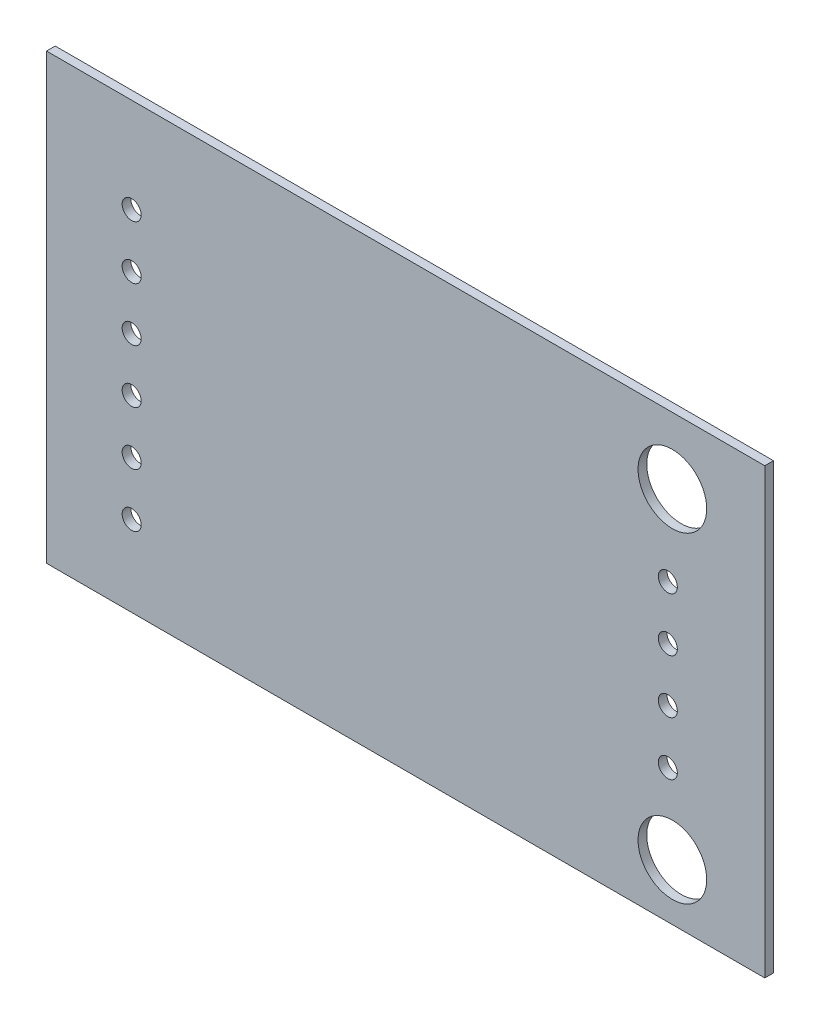
ISO-10303-21;
HEADER;
FILE_DESCRIPTION(('STEP AP214'),'2;1');
FILE_NAME('part.step','',(''),(''),'','','');
FILE_SCHEMA(('AUTOMOTIVE_DESIGN { 1 0 10303 214 1 1 1 1 }'));
ENDSEC;
DATA;
#1=APPLICATION_CONTEXT('core data for automotive mechanical design processes');
#2=APPLICATION_PROTOCOL_DEFINITION('international standard','automotive_design',2000,#1);
#3=PRODUCT_CONTEXT('',#1,'mechanical');
#4=PRODUCT('Part','Part','',(#3));
#5=PRODUCT_RELATED_PRODUCT_CATEGORY('part','',(#4));
#6=PRODUCT_DEFINITION_FORMATION('','',#4);
#7=PRODUCT_DEFINITION_CONTEXT('part definition',#1,'design');
#8=PRODUCT_DEFINITION('design','',#6,#7);
#9=PRODUCT_DEFINITION_SHAPE('','',#8);
#10=(LENGTH_UNIT() NAMED_UNIT(*) SI_UNIT(.MILLI.,.METRE.));
#11=(NAMED_UNIT(*) PLANE_ANGLE_UNIT() SI_UNIT($,.RADIAN.));
#12=(NAMED_UNIT(*) SI_UNIT($,.STERADIAN.) SOLID_ANGLE_UNIT());
#13=UNCERTAINTY_MEASURE_WITH_UNIT(LENGTH_MEASURE(1.E-05),#10,'distance_accuracy_value','');
#14=(GEOMETRIC_REPRESENTATION_CONTEXT(3) GLOBAL_UNCERTAINTY_ASSIGNED_CONTEXT((#13)) GLOBAL_UNIT_ASSIGNED_CONTEXT((#10,
#11,#12)) REPRESENTATION_CONTEXT('',''));
#15=CARTESIAN_POINT('',(0.,0.,0.));
#16=DIRECTION('',(0.,0.,1.));
#17=DIRECTION('',(1.,0.,0.));
#18=AXIS2_PLACEMENT_3D('',#15,#16,#17);
#19=CARTESIAN_POINT('',(1.26999999976454E-05,21.00001642,0.));
#20=DIRECTION('',(-1.,0.,0.));
#21=DIRECTION('',(0.,-1.,0.));
#22=AXIS2_PLACEMENT_3D('',#19,#20,#21);
#23=PLANE('',#22);
#24=DIRECTION('',(0.,-1.,0.));
#25=VECTOR('',#24,1.);
#26=CARTESIAN_POINT('',(1.26999999976454E-05,21.00001642,0.41148));
#27=LINE('',#26,#25);
#28=CARTESIAN_POINT('',(1.26999999976454E-05,21.00001642,0.41148));
#29=VERTEX_POINT('',#28);
#30=CARTESIAN_POINT('',(1.26999999992E-05,1.26999999994702E-05,0.41148));
#31=VERTEX_POINT('',#30);
#32=EDGE_CURVE('E99',#29,#31,#27,.T.);
#33=ORIENTED_EDGE('',*,*,#32,.F.);
#34=DIRECTION('',(0.,0.,1.));
#35=VECTOR('',#34,1.);
#36=CARTESIAN_POINT('',(1.26999999976454E-05,21.00001642,0.));
#37=LINE('',#36,#35);
#38=CARTESIAN_POINT('',(1.26999999976454E-05,21.00001642,0.));
#39=VERTEX_POINT('',#38);
#40=EDGE_CURVE('E11',#39,#29,#37,.T.);
#41=ORIENTED_EDGE('',*,*,#40,.F.);
#42=DIRECTION('',(0.,-1.,0.));
#43=VECTOR('',#42,1.);
#44=CARTESIAN_POINT('',(1.26999999976454E-05,21.00001642,0.));
#45=LINE('',#44,#43);
#46=CARTESIAN_POINT('',(1.26999999992E-05,1.26999999994702E-05,0.));
#47=VERTEX_POINT('',#46);
#48=EDGE_CURVE('E92',#39,#47,#45,.T.);
#49=ORIENTED_EDGE('',*,*,#48,.T.);
#50=DIRECTION('',(0.,0.,1.));
#51=VECTOR('',#50,1.);
#52=CARTESIAN_POINT('',(1.26999999992E-05,1.26999999994702E-05,0.));
#53=LINE('',#52,#51);
#54=EDGE_CURVE('E37',#47,#31,#53,.T.);
#55=ORIENTED_EDGE('',*,*,#54,.T.);
#56=EDGE_LOOP('',(#33,#41,#49,#55));
#57=FACE_BOUND('',#56,.T.);
#58=ADVANCED_FACE('F34',(#57),#23,.T.);
#59=CARTESIAN_POINT('',(34.00001582,21.00001642,0.));
#60=DIRECTION('',(0.,1.,0.));
#61=DIRECTION('',(0.,0.,1.));
#62=AXIS2_PLACEMENT_3D('',#59,#60,#61);
#63=PLANE('',#62);
#64=DIRECTION('',(-1.,0.,0.));
#65=VECTOR('',#64,1.);
#66=CARTESIAN_POINT('',(34.00001582,21.00001642,0.41148));
#67=LINE('',#66,#65);
#68=CARTESIAN_POINT('',(34.00001582,21.00001642,0.41148));
#69=VERTEX_POINT('',#68);
#70=EDGE_CURVE('E94',#69,#29,#67,.T.);
#71=ORIENTED_EDGE('',*,*,#70,.F.);
#72=DIRECTION('',(0.,0.,1.));
#73=VECTOR('',#72,1.);
#74=CARTESIAN_POINT('',(34.00001582,21.00001642,0.));
#75=LINE('',#74,#73);
#76=CARTESIAN_POINT('',(34.00001582,21.00001642,0.));
#77=VERTEX_POINT('',#76);
#78=EDGE_CURVE('E43',#77,#69,#75,.T.);
#79=ORIENTED_EDGE('',*,*,#78,.F.);
#80=DIRECTION('',(-1.,0.,0.));
#81=VECTOR('',#80,1.);
#82=CARTESIAN_POINT('',(34.00001582,21.00001642,0.));
#83=LINE('',#82,#81);
#84=EDGE_CURVE('E89',#77,#39,#83,.T.);
#85=ORIENTED_EDGE('',*,*,#84,.T.);
#86=ORIENTED_EDGE('',*,*,#40,.T.);
#87=EDGE_LOOP('',(#71,#79,#85,#86));
#88=FACE_BOUND('',#87,.T.);
#89=ADVANCED_FACE('F110',(#88),#63,.T.);
#90=CARTESIAN_POINT('',(34.00001582,1.26999999993801E-05,0.));
#91=DIRECTION('',(1.,0.,0.));
#92=DIRECTION('',(0.,0.,-1.));
#93=AXIS2_PLACEMENT_3D('',#90,#91,#92);
#94=PLANE('',#93);
#95=DIRECTION('',(0.,1.,0.));
#96=VECTOR('',#95,1.);
#97=CARTESIAN_POINT('',(34.00001582,1.26999999993801E-05,0.41148));
#98=LINE('',#97,#96);
#99=CARTESIAN_POINT('',(34.00001582,1.26999999993801E-05,0.41148));
#100=VERTEX_POINT('',#99);
#101=EDGE_CURVE('E84',#100,#69,#98,.T.);
#102=ORIENTED_EDGE('',*,*,#101,.F.);
#103=DIRECTION('',(0.,0.,1.));
#104=VECTOR('',#103,1.);
#105=CARTESIAN_POINT('',(34.00001582,1.26999999993801E-05,0.));
#106=LINE('',#105,#104);
#107=CARTESIAN_POINT('',(34.00001582,1.26999999993801E-05,0.));
#108=VERTEX_POINT('',#107);
#109=EDGE_CURVE('E79',#108,#100,#106,.T.);
#110=ORIENTED_EDGE('',*,*,#109,.F.);
#111=DIRECTION('',(0.,1.,0.));
#112=VECTOR('',#111,1.);
#113=CARTESIAN_POINT('',(34.00001582,1.26999999993801E-05,0.));
#114=LINE('',#113,#112);
#115=EDGE_CURVE('E82',#108,#77,#114,.T.);
#116=ORIENTED_EDGE('',*,*,#115,.T.);
#117=ORIENTED_EDGE('',*,*,#78,.T.);
#118=EDGE_LOOP('',(#102,#110,#116,#117));
#119=FACE_BOUND('',#118,.T.);
#120=ADVANCED_FACE('F81',(#119),#94,.T.);
#121=CARTESIAN_POINT('',(1.26999999992E-05,1.26999999994702E-05,0.));
#122=DIRECTION('',(0.,-1.,0.));
#123=DIRECTION('',(1.,0.,0.));
#124=AXIS2_PLACEMENT_3D('',#121,#122,#123);
#125=PLANE('',#124);
#126=DIRECTION('',(1.,0.,0.));
#127=VECTOR('',#126,1.);
#128=CARTESIAN_POINT('',(1.26999999992E-05,1.26999999994702E-05,0.41148));
#129=LINE('',#128,#127);
#130=EDGE_CURVE('E102',#31,#100,#129,.T.);
#131=ORIENTED_EDGE('',*,*,#130,.F.);
#132=ORIENTED_EDGE('',*,*,#54,.F.);
#133=DIRECTION('',(1.,0.,0.));
#134=VECTOR('',#133,1.);
#135=CARTESIAN_POINT('',(1.26999999992E-05,1.26999999994702E-05,0.));
#136=LINE('',#135,#134);
#137=EDGE_CURVE('E88',#47,#108,#136,.T.);
#138=ORIENTED_EDGE('',*,*,#137,.T.);
#139=ORIENTED_EDGE('',*,*,#109,.T.);
#140=EDGE_LOOP('',(#131,#132,#138,#139));
#141=FACE_BOUND('',#140,.T.);
#142=ADVANCED_FACE('F91',(#141),#125,.T.);
#143=CARTESIAN_POINT('',(0.,0.,0.));
#144=DIRECTION('',(0.,0.,1.));
#145=DIRECTION('',(1.,0.,0.));
#146=AXIS2_PLACEMENT_3D('',#143,#144,#145);
#147=PLANE('',#146);
#148=CARTESIAN_POINT('',(29.6250486426004,2.6582362187213,0.));
#149=DIRECTION('',(0.,0.,1.));
#150=DIRECTION('',(1.,0.,0.));
#151=AXIS2_PLACEMENT_3D('',#148,#149,#150);
#152=CIRCLE('',#151,1.62499999999999);
#153=CARTESIAN_POINT('',(31.2500486426004,2.6582362187213,0.));
#154=VERTEX_POINT('',#153);
#155=EDGE_CURVE('E183',#154,#154,#152,.T.);
#156=ORIENTED_EDGE('',*,*,#155,.T.);
#157=EDGE_LOOP('',(#156));
#158=FACE_BOUND('',#157,.T.);
#159=CARTESIAN_POINT('',(29.6250486426004,17.858037309221,0.));
#160=DIRECTION('',(0.,0.,1.));
#161=DIRECTION('',(1.,0.,0.));
#162=AXIS2_PLACEMENT_3D('',#159,#160,#161);
#163=CIRCLE('',#162,1.625);
#164=CARTESIAN_POINT('',(31.2500486426004,17.858037309221,0.));
#165=VERTEX_POINT('',#164);
#166=EDGE_CURVE('E191',#165,#165,#163,.T.);
#167=ORIENTED_EDGE('',*,*,#166,.T.);
#168=EDGE_LOOP('',(#167));
#169=FACE_BOUND('',#168,.T.);
#170=CARTESIAN_POINT('',(4.03071762183416,8.89547967678131,0.));
#171=DIRECTION('',(0.,0.,1.));
#172=DIRECTION('',(-1.,0.,0.));
#173=AXIS2_PLACEMENT_3D('',#170,#171,#172);
#174=CIRCLE('',#173,0.4499991);
#175=CARTESIAN_POINT('',(3.58071852183416,8.89547967678131,0.));
#176=VERTEX_POINT('',#175);
#177=EDGE_CURVE('E197',#176,#176,#174,.T.);
#178=ORIENTED_EDGE('',*,*,#177,.T.);
#179=EDGE_LOOP('',(#178));
#180=FACE_BOUND('',#179,.T.);
#181=CARTESIAN_POINT('',(4.03071762183416,6.35547967678131,0.));
#182=DIRECTION('',(0.,0.,1.));
#183=DIRECTION('',(-1.,0.,0.));
#184=AXIS2_PLACEMENT_3D('',#181,#182,#183);
#185=CIRCLE('',#184,0.4499991);
#186=CARTESIAN_POINT('',(3.58071852183416,6.35547967678131,0.));
#187=VERTEX_POINT('',#186);
#188=EDGE_CURVE('E203',#187,#187,#185,.T.);
#189=ORIENTED_EDGE('',*,*,#188,.T.);
#190=EDGE_LOOP('',(#189));
#191=FACE_BOUND('',#190,.T.);
#192=CARTESIAN_POINT('',(4.03071762183416,16.5154796767813,0.));
#193=DIRECTION('',(0.,0.,1.));
#194=DIRECTION('',(-1.,0.,0.));
#195=AXIS2_PLACEMENT_3D('',#192,#193,#194);
#196=CIRCLE('',#195,0.449999100000001);
#197=CARTESIAN_POINT('',(3.58071852183416,16.5154796767813,0.));
#198=VERTEX_POINT('',#197);
#199=EDGE_CURVE('E209',#198,#198,#196,.T.);
#200=ORIENTED_EDGE('',*,*,#199,.T.);
#201=EDGE_LOOP('',(#200));
#202=FACE_BOUND('',#201,.T.);
#203=CARTESIAN_POINT('',(4.03071762183416,11.4354796767813,0.));
#204=DIRECTION('',(0.,0.,1.));
#205=DIRECTION('',(-1.,0.,0.));
#206=AXIS2_PLACEMENT_3D('',#203,#204,#205);
#207=CIRCLE('',#206,0.4499991);
#208=CARTESIAN_POINT('',(3.58071852183416,11.4354796767813,0.));
#209=VERTEX_POINT('',#208);
#210=EDGE_CURVE('E215',#209,#209,#207,.T.);
#211=ORIENTED_EDGE('',*,*,#210,.T.);
#212=EDGE_LOOP('',(#211));
#213=FACE_BOUND('',#212,.T.);
#214=CARTESIAN_POINT('',(4.03071762183416,13.9754796767813,0.));
#215=DIRECTION('',(0.,0.,1.));
#216=DIRECTION('',(-1.,0.,0.));
#217=AXIS2_PLACEMENT_3D('',#214,#215,#216);
#218=CIRCLE('',#217,0.4499991);
#219=CARTESIAN_POINT('',(3.58071852183416,13.9754796767813,0.));
#220=VERTEX_POINT('',#219);
#221=EDGE_CURVE('E221',#220,#220,#218,.T.);
#222=ORIENTED_EDGE('',*,*,#221,.T.);
#223=EDGE_LOOP('',(#222));
#224=FACE_BOUND('',#223,.T.);
#225=CARTESIAN_POINT('',(4.03071762183416,3.81547967678131,0.));
#226=DIRECTION('',(0.,0.,1.));
#227=DIRECTION('',(-1.,0.,0.));
#228=AXIS2_PLACEMENT_3D('',#225,#226,#227);
#229=CIRCLE('',#228,0.4499991);
#230=CARTESIAN_POINT('',(3.58071852183416,3.81547967678131,0.));
#231=VERTEX_POINT('',#230);
#232=EDGE_CURVE('E227',#231,#231,#229,.T.);
#233=ORIENTED_EDGE('',*,*,#232,.T.);
#234=EDGE_LOOP('',(#233));
#235=FACE_BOUND('',#234,.T.);
#236=CARTESIAN_POINT('',(29.409885994145,6.33181355797748,0.));
#237=DIRECTION('',(0.,0.,1.));
#238=DIRECTION('',(-1.,0.,0.));
#239=AXIS2_PLACEMENT_3D('',#236,#237,#238);
#240=CIRCLE('',#239,0.4499991);
#241=CARTESIAN_POINT('',(28.959886894145,6.33181355797748,0.));
#242=VERTEX_POINT('',#241);
#243=EDGE_CURVE('E233',#242,#242,#240,.T.);
#244=ORIENTED_EDGE('',*,*,#243,.T.);
#245=EDGE_LOOP('',(#244));
#246=FACE_BOUND('',#245,.T.);
#247=CARTESIAN_POINT('',(29.409885994145,13.9518135579775,0.));
#248=DIRECTION('',(0.,0.,1.));
#249=DIRECTION('',(-1.,0.,0.));
#250=AXIS2_PLACEMENT_3D('',#247,#248,#249);
#251=CIRCLE('',#250,0.4499991);
#252=CARTESIAN_POINT('',(28.959886894145,13.9518135579775,0.));
#253=VERTEX_POINT('',#252);
#254=EDGE_CURVE('E239',#253,#253,#251,.T.);
#255=ORIENTED_EDGE('',*,*,#254,.T.);
#256=EDGE_LOOP('',(#255));
#257=FACE_BOUND('',#256,.T.);
#258=CARTESIAN_POINT('',(29.409885994145,8.87181355797748,0.));
#259=DIRECTION('',(0.,0.,1.));
#260=DIRECTION('',(-1.,0.,0.));
#261=AXIS2_PLACEMENT_3D('',#258,#259,#260);
#262=CIRCLE('',#261,0.4499991);
#263=CARTESIAN_POINT('',(28.959886894145,8.87181355797748,0.));
#264=VERTEX_POINT('',#263);
#265=EDGE_CURVE('E245',#264,#264,#262,.T.);
#266=ORIENTED_EDGE('',*,*,#265,.T.);
#267=EDGE_LOOP('',(#266));
#268=FACE_BOUND('',#267,.T.);
#269=CARTESIAN_POINT('',(29.409885994145,11.4118135579775,0.));
#270=DIRECTION('',(0.,0.,1.));
#271=DIRECTION('',(-1.,0.,0.));
#272=AXIS2_PLACEMENT_3D('',#269,#270,#271);
#273=CIRCLE('',#272,0.4499991);
#274=CARTESIAN_POINT('',(28.959886894145,11.4118135579775,0.));
#275=VERTEX_POINT('',#274);
#276=EDGE_CURVE('E103',#275,#275,#273,.T.);
#277=ORIENTED_EDGE('',*,*,#276,.T.);
#278=EDGE_LOOP('',(#277));
#279=FACE_BOUND('',#278,.T.);
#280=ORIENTED_EDGE('',*,*,#48,.F.);
#281=ORIENTED_EDGE('',*,*,#84,.F.);
#282=ORIENTED_EDGE('',*,*,#115,.F.);
#283=ORIENTED_EDGE('',*,*,#137,.F.);
#284=EDGE_LOOP('',(#280,#281,#282,#283));
#285=FACE_BOUND('',#284,.T.);
#286=ADVANCED_FACE('F87',(#158,#169,#180,#191,#202,#213,#224,#235,#246,#257,#268,#279,#285),
#147,.F.);
#287=CARTESIAN_POINT('',(0.,0.,0.41148));
#288=DIRECTION('',(0.,0.,1.));
#289=DIRECTION('',(1.,0.,0.));
#290=AXIS2_PLACEMENT_3D('',#287,#288,#289);
#291=PLANE('',#290);
#292=CARTESIAN_POINT('',(29.6250486426004,2.6582362187213,0.41148));
#293=DIRECTION('',(0.,0.,1.));
#294=DIRECTION('',(1.,0.,0.));
#295=AXIS2_PLACEMENT_3D('',#292,#293,#294);
#296=CIRCLE('',#295,1.62499999999999);
#297=CARTESIAN_POINT('',(31.2500486426004,2.6582362187213,0.41148));
#298=VERTEX_POINT('',#297);
#299=EDGE_CURVE('E186',#298,#298,#296,.T.);
#300=ORIENTED_EDGE('',*,*,#299,.F.);
#301=EDGE_LOOP('',(#300));
#302=FACE_BOUND('',#301,.T.);
#303=CARTESIAN_POINT('',(29.6250486426004,17.858037309221,0.41148));
#304=DIRECTION('',(0.,0.,1.));
#305=DIRECTION('',(1.,0.,0.));
#306=AXIS2_PLACEMENT_3D('',#303,#304,#305);
#307=CIRCLE('',#306,1.625);
#308=CARTESIAN_POINT('',(31.2500486426004,17.858037309221,0.41148));
#309=VERTEX_POINT('',#308);
#310=EDGE_CURVE('E188',#309,#309,#307,.T.);
#311=ORIENTED_EDGE('',*,*,#310,.F.);
#312=EDGE_LOOP('',(#311));
#313=FACE_BOUND('',#312,.T.);
#314=CARTESIAN_POINT('',(4.03071762183416,8.89547967678131,0.41148));
#315=DIRECTION('',(0.,0.,1.));
#316=DIRECTION('',(-1.,0.,0.));
#317=AXIS2_PLACEMENT_3D('',#314,#315,#316);
#318=CIRCLE('',#317,0.4499991);
#319=CARTESIAN_POINT('',(3.58071852183416,8.89547967678131,0.41148));
#320=VERTEX_POINT('',#319);
#321=EDGE_CURVE('E194',#320,#320,#318,.T.);
#322=ORIENTED_EDGE('',*,*,#321,.F.);
#323=EDGE_LOOP('',(#322));
#324=FACE_BOUND('',#323,.T.);
#325=CARTESIAN_POINT('',(4.03071762183416,6.35547967678131,0.41148));
#326=DIRECTION('',(0.,0.,1.));
#327=DIRECTION('',(-1.,0.,0.));
#328=AXIS2_PLACEMENT_3D('',#325,#326,#327);
#329=CIRCLE('',#328,0.4499991);
#330=CARTESIAN_POINT('',(3.58071852183416,6.35547967678131,0.41148));
#331=VERTEX_POINT('',#330);
#332=EDGE_CURVE('E200',#331,#331,#329,.T.);
#333=ORIENTED_EDGE('',*,*,#332,.F.);
#334=EDGE_LOOP('',(#333));
#335=FACE_BOUND('',#334,.T.);
#336=CARTESIAN_POINT('',(4.03071762183416,16.5154796767813,0.41148));
#337=DIRECTION('',(0.,0.,1.));
#338=DIRECTION('',(-1.,0.,0.));
#339=AXIS2_PLACEMENT_3D('',#336,#337,#338);
#340=CIRCLE('',#339,0.449999100000001);
#341=CARTESIAN_POINT('',(3.58071852183416,16.5154796767813,0.41148));
#342=VERTEX_POINT('',#341);
#343=EDGE_CURVE('E206',#342,#342,#340,.T.);
#344=ORIENTED_EDGE('',*,*,#343,.F.);
#345=EDGE_LOOP('',(#344));
#346=FACE_BOUND('',#345,.T.);
#347=CARTESIAN_POINT('',(4.03071762183416,11.4354796767813,0.41148));
#348=DIRECTION('',(0.,0.,1.));
#349=DIRECTION('',(-1.,0.,0.));
#350=AXIS2_PLACEMENT_3D('',#347,#348,#349);
#351=CIRCLE('',#350,0.4499991);
#352=CARTESIAN_POINT('',(3.58071852183416,11.4354796767813,0.41148));
#353=VERTEX_POINT('',#352);
#354=EDGE_CURVE('E212',#353,#353,#351,.T.);
#355=ORIENTED_EDGE('',*,*,#354,.F.);
#356=EDGE_LOOP('',(#355));
#357=FACE_BOUND('',#356,.T.);
#358=CARTESIAN_POINT('',(4.03071762183416,13.9754796767813,0.41148));
#359=DIRECTION('',(0.,0.,1.));
#360=DIRECTION('',(-1.,0.,0.));
#361=AXIS2_PLACEMENT_3D('',#358,#359,#360);
#362=CIRCLE('',#361,0.4499991);
#363=CARTESIAN_POINT('',(3.58071852183416,13.9754796767813,0.41148));
#364=VERTEX_POINT('',#363);
#365=EDGE_CURVE('E218',#364,#364,#362,.T.);
#366=ORIENTED_EDGE('',*,*,#365,.F.);
#367=EDGE_LOOP('',(#366));
#368=FACE_BOUND('',#367,.T.);
#369=CARTESIAN_POINT('',(4.03071762183416,3.81547967678131,0.41148));
#370=DIRECTION('',(0.,0.,1.));
#371=DIRECTION('',(-1.,0.,0.));
#372=AXIS2_PLACEMENT_3D('',#369,#370,#371);
#373=CIRCLE('',#372,0.4499991);
#374=CARTESIAN_POINT('',(3.58071852183416,3.81547967678131,0.41148));
#375=VERTEX_POINT('',#374);
#376=EDGE_CURVE('E224',#375,#375,#373,.T.);
#377=ORIENTED_EDGE('',*,*,#376,.F.);
#378=EDGE_LOOP('',(#377));
#379=FACE_BOUND('',#378,.T.);
#380=CARTESIAN_POINT('',(29.409885994145,6.33181355797748,0.41148));
#381=DIRECTION('',(0.,0.,1.));
#382=DIRECTION('',(-1.,0.,0.));
#383=AXIS2_PLACEMENT_3D('',#380,#381,#382);
#384=CIRCLE('',#383,0.4499991);
#385=CARTESIAN_POINT('',(28.959886894145,6.33181355797748,0.41148));
#386=VERTEX_POINT('',#385);
#387=EDGE_CURVE('E230',#386,#386,#384,.T.);
#388=ORIENTED_EDGE('',*,*,#387,.F.);
#389=EDGE_LOOP('',(#388));
#390=FACE_BOUND('',#389,.T.);
#391=CARTESIAN_POINT('',(29.409885994145,13.9518135579775,0.41148));
#392=DIRECTION('',(0.,0.,1.));
#393=DIRECTION('',(-1.,0.,0.));
#394=AXIS2_PLACEMENT_3D('',#391,#392,#393);
#395=CIRCLE('',#394,0.4499991);
#396=CARTESIAN_POINT('',(28.959886894145,13.9518135579775,0.41148));
#397=VERTEX_POINT('',#396);
#398=EDGE_CURVE('E236',#397,#397,#395,.T.);
#399=ORIENTED_EDGE('',*,*,#398,.F.);
#400=EDGE_LOOP('',(#399));
#401=FACE_BOUND('',#400,.T.);
#402=CARTESIAN_POINT('',(29.409885994145,8.87181355797748,0.41148));
#403=DIRECTION('',(0.,0.,1.));
#404=DIRECTION('',(-1.,0.,0.));
#405=AXIS2_PLACEMENT_3D('',#402,#403,#404);
#406=CIRCLE('',#405,0.4499991);
#407=CARTESIAN_POINT('',(28.959886894145,8.87181355797748,0.41148));
#408=VERTEX_POINT('',#407);
#409=EDGE_CURVE('E242',#408,#408,#406,.T.);
#410=ORIENTED_EDGE('',*,*,#409,.F.);
#411=EDGE_LOOP('',(#410));
#412=FACE_BOUND('',#411,.T.);
#413=CARTESIAN_POINT('',(29.409885994145,11.4118135579775,0.41148));
#414=DIRECTION('',(0.,0.,1.));
#415=DIRECTION('',(-1.,0.,0.));
#416=AXIS2_PLACEMENT_3D('',#413,#414,#415);
#417=CIRCLE('',#416,0.4499991);
#418=CARTESIAN_POINT('',(28.959886894145,11.4118135579775,0.41148));
#419=VERTEX_POINT('',#418);
#420=EDGE_CURVE('E248',#419,#419,#417,.T.);
#421=ORIENTED_EDGE('',*,*,#420,.F.);
#422=EDGE_LOOP('',(#421));
#423=FACE_BOUND('',#422,.T.);
#424=ORIENTED_EDGE('',*,*,#32,.T.);
#425=ORIENTED_EDGE('',*,*,#130,.T.);
#426=ORIENTED_EDGE('',*,*,#101,.T.);
#427=ORIENTED_EDGE('',*,*,#70,.T.);
#428=EDGE_LOOP('',(#424,#425,#426,#427));
#429=FACE_BOUND('',#428,.T.);
#430=ADVANCED_FACE('F109',(#302,#313,#324,#335,#346,#357,#368,#379,#390,#401,#412,#423,#429),
#291,.T.);
#431=CARTESIAN_POINT('',(29.409885994145,11.4118135579775,0.));
#432=DIRECTION('',(0.,0.,1.));
#433=DIRECTION('',(1.,0.,0.));
#434=AXIS2_PLACEMENT_3D('',#431,#432,#433);
#435=CYLINDRICAL_SURFACE('',#434,0.4499991);
#436=ORIENTED_EDGE('',*,*,#276,.F.);
#437=EDGE_LOOP('',(#436));
#438=FACE_BOUND('',#437,.T.);
#439=ORIENTED_EDGE('',*,*,#420,.T.);
#440=EDGE_LOOP('',(#439));
#441=FACE_BOUND('',#440,.T.);
#442=ADVANCED_FACE('F128',(#438,#441),#435,.F.);
#443=CARTESIAN_POINT('',(29.409885994145,8.87181355797748,0.));
#444=DIRECTION('',(0.,0.,1.));
#445=DIRECTION('',(1.,0.,0.));
#446=AXIS2_PLACEMENT_3D('',#443,#444,#445);
#447=CYLINDRICAL_SURFACE('',#446,0.4499991);
#448=ORIENTED_EDGE('',*,*,#265,.F.);
#449=EDGE_LOOP('',(#448));
#450=FACE_BOUND('',#449,.T.);
#451=ORIENTED_EDGE('',*,*,#409,.T.);
#452=EDGE_LOOP('',(#451));
#453=FACE_BOUND('',#452,.T.);
#454=ADVANCED_FACE('F135',(#450,#453),#447,.F.);
#455=CARTESIAN_POINT('',(29.409885994145,13.9518135579775,0.));
#456=DIRECTION('',(0.,0.,1.));
#457=DIRECTION('',(1.,0.,0.));
#458=AXIS2_PLACEMENT_3D('',#455,#456,#457);
#459=CYLINDRICAL_SURFACE('',#458,0.4499991);
#460=ORIENTED_EDGE('',*,*,#254,.F.);
#461=EDGE_LOOP('',(#460));
#462=FACE_BOUND('',#461,.T.);
#463=ORIENTED_EDGE('',*,*,#398,.T.);
#464=EDGE_LOOP('',(#463));
#465=FACE_BOUND('',#464,.T.);
#466=ADVANCED_FACE('F139',(#462,#465),#459,.F.);
#467=CARTESIAN_POINT('',(29.409885994145,6.33181355797748,0.));
#468=DIRECTION('',(0.,0.,1.));
#469=DIRECTION('',(1.,0.,0.));
#470=AXIS2_PLACEMENT_3D('',#467,#468,#469);
#471=CYLINDRICAL_SURFACE('',#470,0.4499991);
#472=ORIENTED_EDGE('',*,*,#243,.F.);
#473=EDGE_LOOP('',(#472));
#474=FACE_BOUND('',#473,.T.);
#475=ORIENTED_EDGE('',*,*,#387,.T.);
#476=EDGE_LOOP('',(#475));
#477=FACE_BOUND('',#476,.T.);
#478=ADVANCED_FACE('F143',(#474,#477),#471,.F.);
#479=CARTESIAN_POINT('',(4.03071762183416,3.81547967678131,0.));
#480=DIRECTION('',(0.,0.,1.));
#481=DIRECTION('',(1.,0.,0.));
#482=AXIS2_PLACEMENT_3D('',#479,#480,#481);
#483=CYLINDRICAL_SURFACE('',#482,0.4499991);
#484=ORIENTED_EDGE('',*,*,#232,.F.);
#485=EDGE_LOOP('',(#484));
#486=FACE_BOUND('',#485,.T.);
#487=ORIENTED_EDGE('',*,*,#376,.T.);
#488=EDGE_LOOP('',(#487));
#489=FACE_BOUND('',#488,.T.);
#490=ADVANCED_FACE('F147',(#486,#489),#483,.F.);
#491=CARTESIAN_POINT('',(4.03071762183416,13.9754796767813,0.));
#492=DIRECTION('',(0.,0.,1.));
#493=DIRECTION('',(1.,0.,0.));
#494=AXIS2_PLACEMENT_3D('',#491,#492,#493);
#495=CYLINDRICAL_SURFACE('',#494,0.4499991);
#496=ORIENTED_EDGE('',*,*,#221,.F.);
#497=EDGE_LOOP('',(#496));
#498=FACE_BOUND('',#497,.T.);
#499=ORIENTED_EDGE('',*,*,#365,.T.);
#500=EDGE_LOOP('',(#499));
#501=FACE_BOUND('',#500,.T.);
#502=ADVANCED_FACE('F151',(#498,#501),#495,.F.);
#503=CARTESIAN_POINT('',(4.03071762183416,11.4354796767813,0.));
#504=DIRECTION('',(0.,0.,1.));
#505=DIRECTION('',(1.,0.,0.));
#506=AXIS2_PLACEMENT_3D('',#503,#504,#505);
#507=CYLINDRICAL_SURFACE('',#506,0.4499991);
#508=ORIENTED_EDGE('',*,*,#210,.F.);
#509=EDGE_LOOP('',(#508));
#510=FACE_BOUND('',#509,.T.);
#511=ORIENTED_EDGE('',*,*,#354,.T.);
#512=EDGE_LOOP('',(#511));
#513=FACE_BOUND('',#512,.T.);
#514=ADVANCED_FACE('F155',(#510,#513),#507,.F.);
#515=CARTESIAN_POINT('',(4.03071762183416,16.5154796767813,0.));
#516=DIRECTION('',(0.,0.,1.));
#517=DIRECTION('',(1.,0.,0.));
#518=AXIS2_PLACEMENT_3D('',#515,#516,#517);
#519=CYLINDRICAL_SURFACE('',#518,0.449999100000001);
#520=ORIENTED_EDGE('',*,*,#199,.F.);
#521=EDGE_LOOP('',(#520));
#522=FACE_BOUND('',#521,.T.);
#523=ORIENTED_EDGE('',*,*,#343,.T.);
#524=EDGE_LOOP('',(#523));
#525=FACE_BOUND('',#524,.T.);
#526=ADVANCED_FACE('F159',(#522,#525),#519,.F.);
#527=CARTESIAN_POINT('',(4.03071762183416,6.35547967678131,0.));
#528=DIRECTION('',(0.,0.,1.));
#529=DIRECTION('',(1.,0.,0.));
#530=AXIS2_PLACEMENT_3D('',#527,#528,#529);
#531=CYLINDRICAL_SURFACE('',#530,0.4499991);
#532=ORIENTED_EDGE('',*,*,#188,.F.);
#533=EDGE_LOOP('',(#532));
#534=FACE_BOUND('',#533,.T.);
#535=ORIENTED_EDGE('',*,*,#332,.T.);
#536=EDGE_LOOP('',(#535));
#537=FACE_BOUND('',#536,.T.);
#538=ADVANCED_FACE('F163',(#534,#537),#531,.F.);
#539=CARTESIAN_POINT('',(4.03071762183416,8.89547967678131,0.));
#540=DIRECTION('',(0.,0.,1.));
#541=DIRECTION('',(1.,0.,0.));
#542=AXIS2_PLACEMENT_3D('',#539,#540,#541);
#543=CYLINDRICAL_SURFACE('',#542,0.4499991);
#544=ORIENTED_EDGE('',*,*,#177,.F.);
#545=EDGE_LOOP('',(#544));
#546=FACE_BOUND('',#545,.T.);
#547=ORIENTED_EDGE('',*,*,#321,.T.);
#548=EDGE_LOOP('',(#547));
#549=FACE_BOUND('',#548,.T.);
#550=ADVANCED_FACE('F167',(#546,#549),#543,.F.);
#551=CARTESIAN_POINT('',(29.6250486426004,17.858037309221,0.));
#552=DIRECTION('',(0.,0.,1.));
#553=DIRECTION('',(1.,0.,0.));
#554=AXIS2_PLACEMENT_3D('',#551,#552,#553);
#555=CYLINDRICAL_SURFACE('',#554,1.625);
#556=ORIENTED_EDGE('',*,*,#166,.F.);
#557=EDGE_LOOP('',(#556));
#558=FACE_BOUND('',#557,.T.);
#559=ORIENTED_EDGE('',*,*,#310,.T.);
#560=EDGE_LOOP('',(#559));
#561=FACE_BOUND('',#560,.T.);
#562=ADVANCED_FACE('F171',(#558,#561),#555,.F.);
#563=CARTESIAN_POINT('',(29.6250486426004,2.6582362187213,0.));
#564=DIRECTION('',(0.,0.,1.));
#565=DIRECTION('',(1.,0.,0.));
#566=AXIS2_PLACEMENT_3D('',#563,#564,#565);
#567=CYLINDRICAL_SURFACE('',#566,1.62499999999999);
#568=ORIENTED_EDGE('',*,*,#155,.F.);
#569=EDGE_LOOP('',(#568));
#570=FACE_BOUND('',#569,.T.);
#571=ORIENTED_EDGE('',*,*,#299,.T.);
#572=EDGE_LOOP('',(#571));
#573=FACE_BOUND('',#572,.T.);
#574=ADVANCED_FACE('F175',(#570,#573),#567,.F.);
#575=CLOSED_SHELL('',(#58,#89,#120,#142,#286,#430,#442,#454,#466,#478,#490,#502,#514,#526,#538,
#550,#562,#574));
#576=MANIFOLD_SOLID_BREP('B2',#575);
#577=ADVANCED_BREP_SHAPE_REPRESENTATION('',(#18,#576),#14);
#578=SHAPE_DEFINITION_REPRESENTATION(#9,#577);
ENDSEC;
END-ISO-10303-21;
